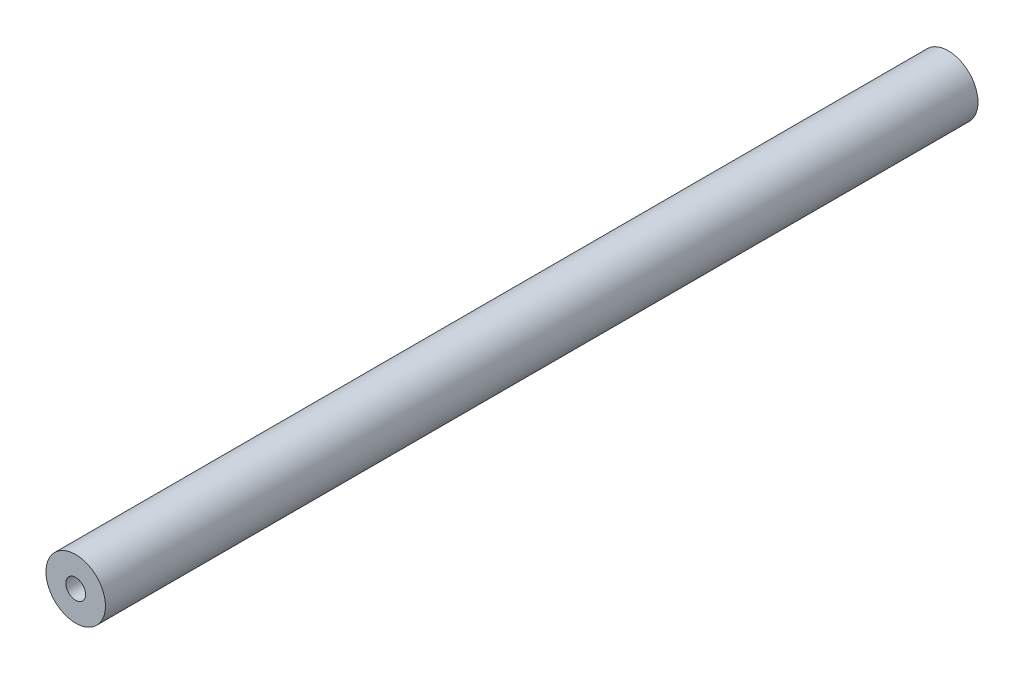
ISO-10303-21;
HEADER;
FILE_DESCRIPTION(('STEP AP214'),'2;1');
FILE_NAME('part.step','',(''),(''),'','','');
FILE_SCHEMA(('AUTOMOTIVE_DESIGN { 1 0 10303 214 1 1 1 1 }'));
ENDSEC;
DATA;
#1=APPLICATION_CONTEXT('core data for automotive mechanical design processes');
#2=APPLICATION_PROTOCOL_DEFINITION('international standard','automotive_design',2000,#1);
#3=PRODUCT_CONTEXT('',#1,'mechanical');
#4=PRODUCT('Part','Part','',(#3));
#5=PRODUCT_RELATED_PRODUCT_CATEGORY('part','',(#4));
#6=PRODUCT_DEFINITION_FORMATION('','',#4);
#7=PRODUCT_DEFINITION_CONTEXT('part definition',#1,'design');
#8=PRODUCT_DEFINITION('design','',#6,#7);
#9=PRODUCT_DEFINITION_SHAPE('','',#8);
#10=(LENGTH_UNIT() NAMED_UNIT(*) SI_UNIT(.MILLI.,.METRE.));
#11=(NAMED_UNIT(*) PLANE_ANGLE_UNIT() SI_UNIT($,.RADIAN.));
#12=(NAMED_UNIT(*) SI_UNIT($,.STERADIAN.) SOLID_ANGLE_UNIT());
#13=UNCERTAINTY_MEASURE_WITH_UNIT(LENGTH_MEASURE(1.E-05),#10,'distance_accuracy_value','');
#14=(GEOMETRIC_REPRESENTATION_CONTEXT(3) GLOBAL_UNCERTAINTY_ASSIGNED_CONTEXT((#13)) GLOBAL_UNIT_ASSIGNED_CONTEXT((#10,
#11,#12)) REPRESENTATION_CONTEXT('',''));
#15=CARTESIAN_POINT('',(0.,0.,0.));
#16=DIRECTION('',(0.,0.,1.));
#17=DIRECTION('',(1.,0.,0.));
#18=AXIS2_PLACEMENT_3D('',#15,#16,#17);
#19=CARTESIAN_POINT('',(0.,0.,139.7));
#20=DIRECTION('',(0.,0.,1.));
#21=DIRECTION('',(1.,0.,0.));
#22=AXIS2_PLACEMENT_3D('',#19,#20,#21);
#23=PLANE('',#22);
#24=CARTESIAN_POINT('',(0.,0.,139.7));
#25=DIRECTION('',(0.,0.,1.));
#26=DIRECTION('',(1.,0.,0.));
#27=AXIS2_PLACEMENT_3D('',#24,#25,#26);
#28=CIRCLE('',#27,4.7625);
#29=CARTESIAN_POINT('',(4.7625,0.,139.7));
#30=VERTEX_POINT('',#29);
#31=EDGE_CURVE('E10',#30,#30,#28,.T.);
#32=ORIENTED_EDGE('',*,*,#31,.T.);
#33=EDGE_LOOP('',(#32));
#34=FACE_BOUND('',#33,.T.);
#35=CARTESIAN_POINT('',(0.,0.,139.7));
#36=DIRECTION('',(0.,0.,1.));
#37=DIRECTION('',(1.,0.,0.));
#38=AXIS2_PLACEMENT_3D('',#35,#36,#37);
#39=CIRCLE('',#38,1.5875);
#40=CARTESIAN_POINT('',(1.5875,0.,139.7));
#41=VERTEX_POINT('',#40);
#42=EDGE_CURVE('E50',#41,#41,#39,.T.);
#43=ORIENTED_EDGE('',*,*,#42,.F.);
#44=EDGE_LOOP('',(#43));
#45=FACE_BOUND('',#44,.T.);
#46=ADVANCED_FACE('F37',(#34,#45),#23,.T.);
#47=CARTESIAN_POINT('',(0.,0.,0.));
#48=DIRECTION('',(0.,0.,1.));
#49=DIRECTION('',(1.,0.,0.));
#50=AXIS2_PLACEMENT_3D('',#47,#48,#49);
#51=PLANE('',#50);
#52=CARTESIAN_POINT('',(0.,0.,0.));
#53=DIRECTION('',(0.,0.,1.));
#54=DIRECTION('',(1.,0.,0.));
#55=AXIS2_PLACEMENT_3D('',#52,#53,#54);
#56=CIRCLE('',#55,4.7625);
#57=CARTESIAN_POINT('',(4.7625,0.,0.));
#58=VERTEX_POINT('',#57);
#59=EDGE_CURVE('E41',#58,#58,#56,.T.);
#60=ORIENTED_EDGE('',*,*,#59,.F.);
#61=EDGE_LOOP('',(#60));
#62=FACE_BOUND('',#61,.T.);
#63=CARTESIAN_POINT('',(0.,0.,0.));
#64=DIRECTION('',(0.,0.,1.));
#65=DIRECTION('',(1.,0.,0.));
#66=AXIS2_PLACEMENT_3D('',#63,#64,#65);
#67=CIRCLE('',#66,1.5875);
#68=CARTESIAN_POINT('',(1.5875,0.,0.));
#69=VERTEX_POINT('',#68);
#70=EDGE_CURVE('E52',#69,#69,#67,.T.);
#71=ORIENTED_EDGE('',*,*,#70,.T.);
#72=EDGE_LOOP('',(#71));
#73=FACE_BOUND('',#72,.T.);
#74=ADVANCED_FACE('F64',(#62,#73),#51,.F.);
#75=CARTESIAN_POINT('',(0.,0.,139.7));
#76=DIRECTION('',(0.,0.,-1.));
#77=DIRECTION('',(-1.,0.,0.));
#78=AXIS2_PLACEMENT_3D('',#75,#76,#77);
#79=CYLINDRICAL_SURFACE('',#78,4.7625);
#80=ORIENTED_EDGE('',*,*,#31,.F.);
#81=EDGE_LOOP('',(#80));
#82=FACE_BOUND('',#81,.T.);
#83=ORIENTED_EDGE('',*,*,#59,.T.);
#84=EDGE_LOOP('',(#83));
#85=FACE_BOUND('',#84,.T.);
#86=ADVANCED_FACE('F39',(#82,#85),#79,.T.);
#87=CARTESIAN_POINT('',(0.,0.,139.7));
#88=DIRECTION('',(0.,0.,-1.));
#89=DIRECTION('',(-1.,0.,0.));
#90=AXIS2_PLACEMENT_3D('',#87,#88,#89);
#91=CYLINDRICAL_SURFACE('',#90,1.5875);
#92=ORIENTED_EDGE('',*,*,#42,.T.);
#93=EDGE_LOOP('',(#92));
#94=FACE_BOUND('',#93,.T.);
#95=ORIENTED_EDGE('',*,*,#70,.F.);
#96=EDGE_LOOP('',(#95));
#97=FACE_BOUND('',#96,.T.);
#98=ADVANCED_FACE('F60',(#94,#97),#91,.F.);
#99=CLOSED_SHELL('',(#46,#74,#86,#98));
#100=MANIFOLD_SOLID_BREP('B2',#99);
#101=ADVANCED_BREP_SHAPE_REPRESENTATION('',(#18,#100),#14);
#102=SHAPE_DEFINITION_REPRESENTATION(#9,#101);
ENDSEC;
END-ISO-10303-21;
